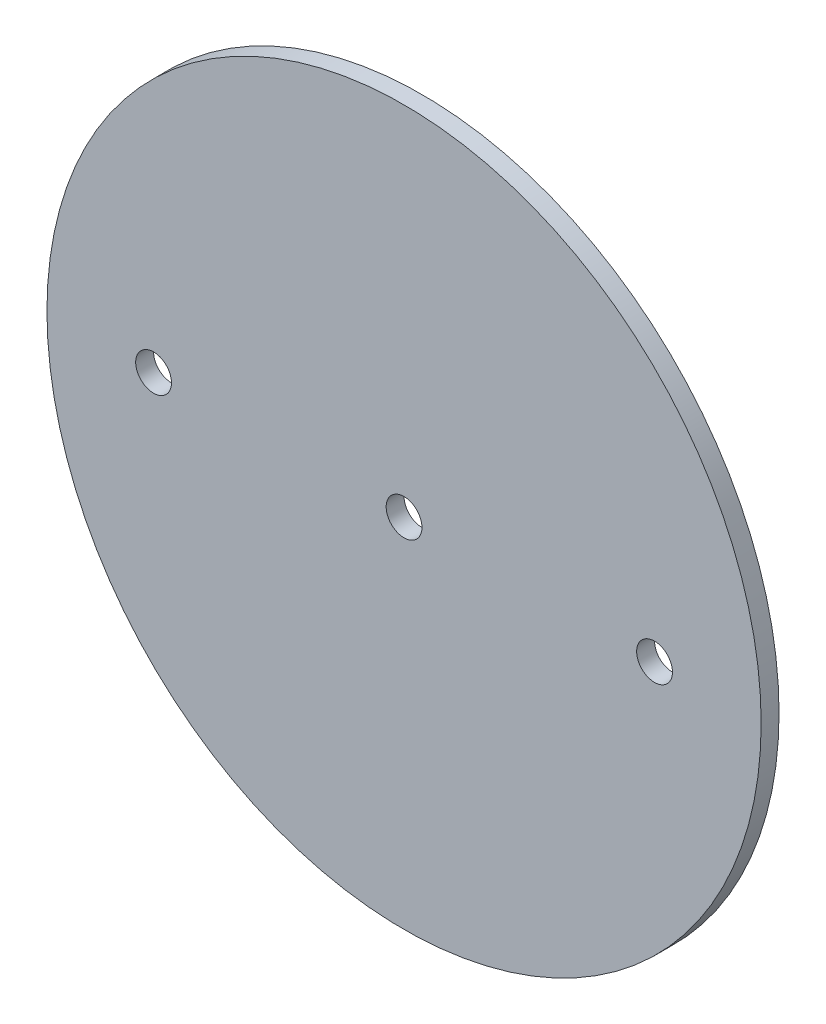
ISO-10303-21;
HEADER;
FILE_DESCRIPTION(('STEP AP214'),'2;1');
FILE_NAME('part.step','',(''),(''),'','','');
FILE_SCHEMA(('AUTOMOTIVE_DESIGN { 1 0 10303 214 1 1 1 1 }'));
ENDSEC;
DATA;
#1=APPLICATION_CONTEXT('core data for automotive mechanical design processes');
#2=APPLICATION_PROTOCOL_DEFINITION('international standard','automotive_design',2000,#1);
#3=PRODUCT_CONTEXT('',#1,'mechanical');
#4=PRODUCT('Part','Part','',(#3));
#5=PRODUCT_RELATED_PRODUCT_CATEGORY('part','',(#4));
#6=PRODUCT_DEFINITION_FORMATION('','',#4);
#7=PRODUCT_DEFINITION_CONTEXT('part definition',#1,'design');
#8=PRODUCT_DEFINITION('design','',#6,#7);
#9=PRODUCT_DEFINITION_SHAPE('','',#8);
#10=(LENGTH_UNIT() NAMED_UNIT(*) SI_UNIT(.MILLI.,.METRE.));
#11=(NAMED_UNIT(*) PLANE_ANGLE_UNIT() SI_UNIT($,.RADIAN.));
#12=(NAMED_UNIT(*) SI_UNIT($,.STERADIAN.) SOLID_ANGLE_UNIT());
#13=UNCERTAINTY_MEASURE_WITH_UNIT(LENGTH_MEASURE(1.E-05),#10,'distance_accuracy_value','');
#14=(GEOMETRIC_REPRESENTATION_CONTEXT(3) GLOBAL_UNCERTAINTY_ASSIGNED_CONTEXT((#13)) GLOBAL_UNIT_ASSIGNED_CONTEXT((#10,
#11,#12)) REPRESENTATION_CONTEXT('',''));
#15=CARTESIAN_POINT('',(0.,0.,0.));
#16=DIRECTION('',(0.,0.,1.));
#17=DIRECTION('',(1.,0.,0.));
#18=AXIS2_PLACEMENT_3D('',#15,#16,#17);
#19=CARTESIAN_POINT('',(0.,0.,1.5875));
#20=DIRECTION('',(0.,0.,-1.));
#21=DIRECTION('',(-1.,0.,0.));
#22=AXIS2_PLACEMENT_3D('',#19,#20,#21);
#23=CYLINDRICAL_SURFACE('',#22,63.373);
#24=CARTESIAN_POINT('',(0.,0.,1.5875));
#25=DIRECTION('',(0.,0.,1.));
#26=DIRECTION('',(1.,0.,0.));
#27=AXIS2_PLACEMENT_3D('',#24,#25,#26);
#28=CIRCLE('',#27,63.373);
#29=CARTESIAN_POINT('',(63.373,0.,1.5875));
#30=VERTEX_POINT('',#29);
#31=EDGE_CURVE('E10',#30,#30,#28,.T.);
#32=ORIENTED_EDGE('',*,*,#31,.F.);
#33=EDGE_LOOP('',(#32));
#34=FACE_BOUND('',#33,.T.);
#35=CARTESIAN_POINT('',(0.,0.,-1.5875));
#36=DIRECTION('',(0.,0.,1.));
#37=DIRECTION('',(1.,0.,0.));
#38=AXIS2_PLACEMENT_3D('',#35,#36,#37);
#39=CIRCLE('',#38,63.373);
#40=CARTESIAN_POINT('',(63.373,0.,-1.5875));
#41=VERTEX_POINT('',#40);
#42=EDGE_CURVE('E46',#41,#41,#39,.T.);
#43=ORIENTED_EDGE('',*,*,#42,.T.);
#44=EDGE_LOOP('',(#43));
#45=FACE_BOUND('',#44,.T.);
#46=ADVANCED_FACE('F43',(#34,#45),#23,.T.);
#47=CARTESIAN_POINT('',(0.,0.,1.5875));
#48=DIRECTION('',(0.,0.,1.));
#49=DIRECTION('',(1.,0.,0.));
#50=AXIS2_PLACEMENT_3D('',#47,#48,#49);
#51=PLANE('',#50);
#52=CARTESIAN_POINT('',(0.,0.,1.5875));
#53=DIRECTION('',(0.,0.,1.));
#54=DIRECTION('',(1.,0.,0.));
#55=AXIS2_PLACEMENT_3D('',#52,#53,#54);
#56=CIRCLE('',#55,3.17499999999999);
#57=CARTESIAN_POINT('',(3.17499999999999,0.,1.5875));
#58=VERTEX_POINT('',#57);
#59=EDGE_CURVE('E69',#58,#58,#56,.T.);
#60=ORIENTED_EDGE('',*,*,#59,.F.);
#61=EDGE_LOOP('',(#60));
#62=FACE_BOUND('',#61,.T.);
#63=CARTESIAN_POINT('',(44.45,0.,1.5875));
#64=DIRECTION('',(0.,0.,1.));
#65=DIRECTION('',(1.,0.,0.));
#66=AXIS2_PLACEMENT_3D('',#63,#64,#65);
#67=CIRCLE('',#66,3.17499999999998);
#68=CARTESIAN_POINT('',(47.625,0.,1.5875));
#69=VERTEX_POINT('',#68);
#70=EDGE_CURVE('E63',#69,#69,#67,.T.);
#71=ORIENTED_EDGE('',*,*,#70,.F.);
#72=EDGE_LOOP('',(#71));
#73=FACE_BOUND('',#72,.T.);
#74=CARTESIAN_POINT('',(-44.45,0.,1.5875));
#75=DIRECTION('',(0.,0.,1.));
#76=DIRECTION('',(1.,0.,0.));
#77=AXIS2_PLACEMENT_3D('',#74,#75,#76);
#78=CIRCLE('',#77,3.17499999999999);
#79=CARTESIAN_POINT('',(-41.275,0.,1.5875));
#80=VERTEX_POINT('',#79);
#81=EDGE_CURVE('E57',#80,#80,#78,.T.);
#82=ORIENTED_EDGE('',*,*,#81,.F.);
#83=EDGE_LOOP('',(#82));
#84=FACE_BOUND('',#83,.T.);
#85=ORIENTED_EDGE('',*,*,#31,.T.);
#86=EDGE_LOOP('',(#85));
#87=FACE_BOUND('',#86,.T.);
#88=ADVANCED_FACE('F75',(#62,#73,#84,#87),#51,.T.);
#89=CARTESIAN_POINT('',(0.,0.,-1.5875));
#90=DIRECTION('',(0.,0.,1.));
#91=DIRECTION('',(1.,0.,0.));
#92=AXIS2_PLACEMENT_3D('',#89,#90,#91);
#93=PLANE('',#92);
#94=CARTESIAN_POINT('',(0.,0.,-1.5875));
#95=DIRECTION('',(0.,0.,1.));
#96=DIRECTION('',(1.,0.,0.));
#97=AXIS2_PLACEMENT_3D('',#94,#95,#96);
#98=CIRCLE('',#97,3.17499999999999);
#99=CARTESIAN_POINT('',(3.17499999999999,0.,-1.5875));
#100=VERTEX_POINT('',#99);
#101=EDGE_CURVE('E66',#100,#100,#98,.T.);
#102=ORIENTED_EDGE('',*,*,#101,.T.);
#103=EDGE_LOOP('',(#102));
#104=FACE_BOUND('',#103,.T.);
#105=CARTESIAN_POINT('',(44.45,0.,-1.5875));
#106=DIRECTION('',(0.,0.,1.));
#107=DIRECTION('',(1.,0.,0.));
#108=AXIS2_PLACEMENT_3D('',#105,#106,#107);
#109=CIRCLE('',#108,3.17499999999999);
#110=CARTESIAN_POINT('',(47.625,0.,-1.5875));
#111=VERTEX_POINT('',#110);
#112=EDGE_CURVE('E60',#111,#111,#109,.T.);
#113=ORIENTED_EDGE('',*,*,#112,.T.);
#114=EDGE_LOOP('',(#113));
#115=FACE_BOUND('',#114,.T.);
#116=CARTESIAN_POINT('',(-44.45,0.,-1.5875));
#117=DIRECTION('',(0.,0.,1.));
#118=DIRECTION('',(1.,0.,0.));
#119=AXIS2_PLACEMENT_3D('',#116,#117,#118);
#120=CIRCLE('',#119,3.17499999999999);
#121=CARTESIAN_POINT('',(-41.275,0.,-1.5875));
#122=VERTEX_POINT('',#121);
#123=EDGE_CURVE('E53',#122,#122,#120,.T.);
#124=ORIENTED_EDGE('',*,*,#123,.T.);
#125=EDGE_LOOP('',(#124));
#126=FACE_BOUND('',#125,.T.);
#127=ORIENTED_EDGE('',*,*,#42,.F.);
#128=EDGE_LOOP('',(#127));
#129=FACE_BOUND('',#128,.T.);
#130=ADVANCED_FACE('F78',(#104,#115,#126,#129),#93,.F.);
#131=CARTESIAN_POINT('',(-44.45,0.,1.5875));
#132=DIRECTION('',(0.,0.,1.));
#133=DIRECTION('',(1.,0.,0.));
#134=AXIS2_PLACEMENT_3D('',#131,#132,#133);
#135=CYLINDRICAL_SURFACE('',#134,3.17499999999999);
#136=ORIENTED_EDGE('',*,*,#123,.F.);
#137=EDGE_LOOP('',(#136));
#138=FACE_BOUND('',#137,.T.);
#139=ORIENTED_EDGE('',*,*,#81,.T.);
#140=EDGE_LOOP('',(#139));
#141=FACE_BOUND('',#140,.T.);
#142=ADVANCED_FACE('F84',(#138,#141),#135,.F.);
#143=CARTESIAN_POINT('',(44.45,0.,1.5875));
#144=DIRECTION('',(0.,0.,1.));
#145=DIRECTION('',(1.,0.,0.));
#146=AXIS2_PLACEMENT_3D('',#143,#144,#145);
#147=CYLINDRICAL_SURFACE('',#146,3.17499999999999);
#148=ORIENTED_EDGE('',*,*,#112,.F.);
#149=EDGE_LOOP('',(#148));
#150=FACE_BOUND('',#149,.T.);
#151=ORIENTED_EDGE('',*,*,#70,.T.);
#152=EDGE_LOOP('',(#151));
#153=FACE_BOUND('',#152,.T.);
#154=ADVANCED_FACE('F86',(#150,#153),#147,.F.);
#155=CARTESIAN_POINT('',(0.,0.,1.5875));
#156=DIRECTION('',(0.,0.,1.));
#157=DIRECTION('',(1.,0.,0.));
#158=AXIS2_PLACEMENT_3D('',#155,#156,#157);
#159=CYLINDRICAL_SURFACE('',#158,3.17499999999999);
#160=ORIENTED_EDGE('',*,*,#101,.F.);
#161=EDGE_LOOP('',(#160));
#162=FACE_BOUND('',#161,.T.);
#163=ORIENTED_EDGE('',*,*,#59,.T.);
#164=EDGE_LOOP('',(#163));
#165=FACE_BOUND('',#164,.T.);
#166=ADVANCED_FACE('F73',(#162,#165),#159,.F.);
#167=CLOSED_SHELL('',(#46,#88,#130,#142,#154,#166));
#168=MANIFOLD_SOLID_BREP('B2',#167);
#169=ADVANCED_BREP_SHAPE_REPRESENTATION('',(#18,#168),#14);
#170=SHAPE_DEFINITION_REPRESENTATION(#9,#169);
ENDSEC;
END-ISO-10303-21;
